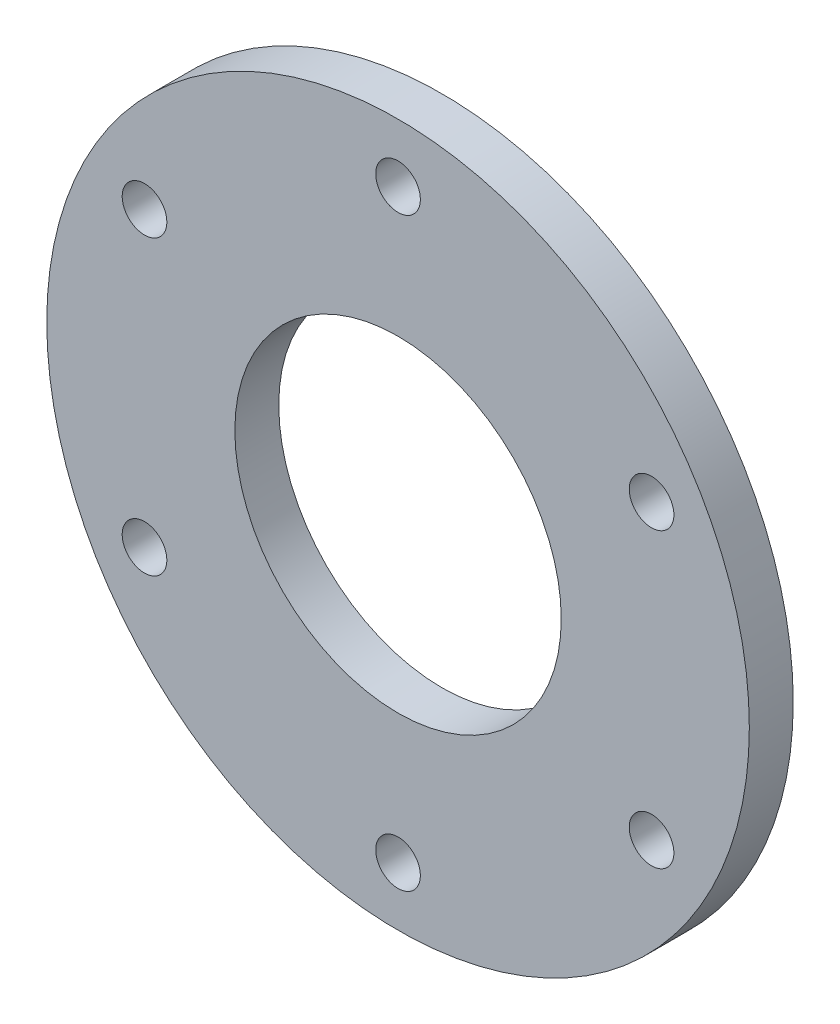
ISO-10303-21;
HEADER;
FILE_DESCRIPTION(('STEP AP214'),'2;1');
FILE_NAME('part.step','',(''),(''),'','','');
FILE_SCHEMA(('AUTOMOTIVE_DESIGN { 1 0 10303 214 1 1 1 1 }'));
ENDSEC;
DATA;
#1=APPLICATION_CONTEXT('core data for automotive mechanical design processes');
#2=APPLICATION_PROTOCOL_DEFINITION('international standard','automotive_design',2000,#1);
#3=PRODUCT_CONTEXT('',#1,'mechanical');
#4=PRODUCT('Part','Part','',(#3));
#5=PRODUCT_RELATED_PRODUCT_CATEGORY('part','',(#4));
#6=PRODUCT_DEFINITION_FORMATION('','',#4);
#7=PRODUCT_DEFINITION_CONTEXT('part definition',#1,'design');
#8=PRODUCT_DEFINITION('design','',#6,#7);
#9=PRODUCT_DEFINITION_SHAPE('','',#8);
#10=(LENGTH_UNIT() NAMED_UNIT(*) SI_UNIT(.MILLI.,.METRE.));
#11=(NAMED_UNIT(*) PLANE_ANGLE_UNIT() SI_UNIT($,.RADIAN.));
#12=(NAMED_UNIT(*) SI_UNIT($,.STERADIAN.) SOLID_ANGLE_UNIT());
#13=UNCERTAINTY_MEASURE_WITH_UNIT(LENGTH_MEASURE(1.E-05),#10,'distance_accuracy_value','');
#14=(GEOMETRIC_REPRESENTATION_CONTEXT(3) GLOBAL_UNCERTAINTY_ASSIGNED_CONTEXT((#13)) GLOBAL_UNIT_ASSIGNED_CONTEXT((#10,
#11,#12)) REPRESENTATION_CONTEXT('',''));
#15=CARTESIAN_POINT('',(0.,0.,0.));
#16=DIRECTION('',(0.,0.,1.));
#17=DIRECTION('',(1.,0.,0.));
#18=AXIS2_PLACEMENT_3D('',#15,#16,#17);
#19=CARTESIAN_POINT('',(0.,0.,3.));
#20=DIRECTION('',(0.,0.,1.));
#21=DIRECTION('',(1.,0.,0.));
#22=AXIS2_PLACEMENT_3D('',#19,#20,#21);
#23=PLANE('',#22);
#24=CARTESIAN_POINT('',(-17.3205080756888,-10.,3.));
#25=DIRECTION('',(0.,0.,1.));
#26=DIRECTION('',(1.,0.,0.));
#27=AXIS2_PLACEMENT_3D('',#24,#25,#26);
#28=CIRCLE('',#27,1.525);
#29=CARTESIAN_POINT('',(-15.7955080756888,-10.,3.));
#30=VERTEX_POINT('',#29);
#31=EDGE_CURVE('E72',#30,#30,#28,.T.);
#32=ORIENTED_EDGE('',*,*,#31,.F.);
#33=EDGE_LOOP('',(#32));
#34=FACE_BOUND('',#33,.T.);
#35=CARTESIAN_POINT('',(17.3205080756888,-10.,3.));
#36=DIRECTION('',(0.,0.,1.));
#37=DIRECTION('',(1.,0.,0.));
#38=AXIS2_PLACEMENT_3D('',#35,#36,#37);
#39=CIRCLE('',#38,1.525);
#40=CARTESIAN_POINT('',(18.8455080756888,-10.,3.));
#41=VERTEX_POINT('',#40);
#42=EDGE_CURVE('E60',#41,#41,#39,.T.);
#43=ORIENTED_EDGE('',*,*,#42,.F.);
#44=EDGE_LOOP('',(#43));
#45=FACE_BOUND('',#44,.T.);
#46=CARTESIAN_POINT('',(0.,20.,3.));
#47=DIRECTION('',(0.,0.,1.));
#48=DIRECTION('',(1.,0.,0.));
#49=AXIS2_PLACEMENT_3D('',#46,#47,#48);
#50=CIRCLE('',#49,1.525);
#51=CARTESIAN_POINT('',(1.525,20.,3.));
#52=VERTEX_POINT('',#51);
#53=EDGE_CURVE('E48',#52,#52,#50,.T.);
#54=ORIENTED_EDGE('',*,*,#53,.F.);
#55=EDGE_LOOP('',(#54));
#56=FACE_BOUND('',#55,.T.);
#57=CARTESIAN_POINT('',(0.,0.,3.));
#58=DIRECTION('',(0.,0.,1.));
#59=DIRECTION('',(1.,0.,0.));
#60=AXIS2_PLACEMENT_3D('',#57,#58,#59);
#61=CIRCLE('',#60,24.);
#62=CARTESIAN_POINT('',(24.,0.,3.));
#63=VERTEX_POINT('',#62);
#64=EDGE_CURVE('E10',#63,#63,#61,.T.);
#65=ORIENTED_EDGE('',*,*,#64,.T.);
#66=EDGE_LOOP('',(#65));
#67=FACE_BOUND('',#66,.T.);
#68=CARTESIAN_POINT('',(0.,0.,3.));
#69=DIRECTION('',(0.,0.,1.));
#70=DIRECTION('',(1.,0.,0.));
#71=AXIS2_PLACEMENT_3D('',#68,#69,#70);
#72=CIRCLE('',#71,11.15);
#73=CARTESIAN_POINT('',(11.15,0.,3.));
#74=VERTEX_POINT('',#73);
#75=EDGE_CURVE('E43',#74,#74,#72,.T.);
#76=ORIENTED_EDGE('',*,*,#75,.F.);
#77=EDGE_LOOP('',(#76));
#78=FACE_BOUND('',#77,.T.);
#79=CARTESIAN_POINT('',(17.3205080756888,10.,3.));
#80=DIRECTION('',(0.,0.,1.));
#81=DIRECTION('',(1.,0.,0.));
#82=AXIS2_PLACEMENT_3D('',#79,#80,#81);
#83=CIRCLE('',#82,1.525);
#84=CARTESIAN_POINT('',(18.8455080756888,10.,3.));
#85=VERTEX_POINT('',#84);
#86=EDGE_CURVE('E54',#85,#85,#83,.T.);
#87=ORIENTED_EDGE('',*,*,#86,.F.);
#88=EDGE_LOOP('',(#87));
#89=FACE_BOUND('',#88,.T.);
#90=CARTESIAN_POINT('',(0.,-20.,3.));
#91=DIRECTION('',(0.,0.,1.));
#92=DIRECTION('',(1.,0.,0.));
#93=AXIS2_PLACEMENT_3D('',#90,#91,#92);
#94=CIRCLE('',#93,1.525);
#95=CARTESIAN_POINT('',(1.525,-20.,3.));
#96=VERTEX_POINT('',#95);
#97=EDGE_CURVE('E66',#96,#96,#94,.T.);
#98=ORIENTED_EDGE('',*,*,#97,.F.);
#99=EDGE_LOOP('',(#98));
#100=FACE_BOUND('',#99,.T.);
#101=CARTESIAN_POINT('',(-17.3205080756888,9.99999999999999,3.));
#102=DIRECTION('',(0.,0.,1.));
#103=DIRECTION('',(1.,0.,0.));
#104=AXIS2_PLACEMENT_3D('',#101,#102,#103);
#105=CIRCLE('',#104,1.525);
#106=CARTESIAN_POINT('',(-15.7955080756888,9.99999999999999,3.));
#107=VERTEX_POINT('',#106);
#108=EDGE_CURVE('E78',#107,#107,#105,.T.);
#109=ORIENTED_EDGE('',*,*,#108,.F.);
#110=EDGE_LOOP('',(#109));
#111=FACE_BOUND('',#110,.T.);
#112=ADVANCED_FACE('F32',(#34,#45,#56,#67,#78,#89,#100,#111),#23,.T.);
#113=CARTESIAN_POINT('',(0.,0.,0.));
#114=DIRECTION('',(0.,0.,1.));
#115=DIRECTION('',(1.,0.,0.));
#116=AXIS2_PLACEMENT_3D('',#113,#114,#115);
#117=PLANE('',#116);
#118=CARTESIAN_POINT('',(0.,0.,0.));
#119=DIRECTION('',(0.,0.,1.));
#120=DIRECTION('',(1.,0.,0.));
#121=AXIS2_PLACEMENT_3D('',#118,#119,#120);
#122=CIRCLE('',#121,24.);
#123=CARTESIAN_POINT('',(24.,0.,0.));
#124=VERTEX_POINT('',#123);
#125=EDGE_CURVE('E36',#124,#124,#122,.T.);
#126=ORIENTED_EDGE('',*,*,#125,.F.);
#127=EDGE_LOOP('',(#126));
#128=FACE_BOUND('',#127,.T.);
#129=CARTESIAN_POINT('',(0.,0.,0.));
#130=DIRECTION('',(0.,0.,1.));
#131=DIRECTION('',(1.,0.,0.));
#132=AXIS2_PLACEMENT_3D('',#129,#130,#131);
#133=CIRCLE('',#132,11.15);
#134=CARTESIAN_POINT('',(11.15,0.,0.));
#135=VERTEX_POINT('',#134);
#136=EDGE_CURVE('E45',#135,#135,#133,.T.);
#137=ORIENTED_EDGE('',*,*,#136,.T.);
#138=EDGE_LOOP('',(#137));
#139=FACE_BOUND('',#138,.T.);
#140=CARTESIAN_POINT('',(0.,20.,0.));
#141=DIRECTION('',(0.,0.,1.));
#142=DIRECTION('',(1.,0.,0.));
#143=AXIS2_PLACEMENT_3D('',#140,#141,#142);
#144=CIRCLE('',#143,1.525);
#145=CARTESIAN_POINT('',(1.525,20.,0.));
#146=VERTEX_POINT('',#145);
#147=EDGE_CURVE('E51',#146,#146,#144,.T.);
#148=ORIENTED_EDGE('',*,*,#147,.T.);
#149=EDGE_LOOP('',(#148));
#150=FACE_BOUND('',#149,.T.);
#151=CARTESIAN_POINT('',(17.3205080756888,10.,0.));
#152=DIRECTION('',(0.,0.,1.));
#153=DIRECTION('',(1.,0.,0.));
#154=AXIS2_PLACEMENT_3D('',#151,#152,#153);
#155=CIRCLE('',#154,1.525);
#156=CARTESIAN_POINT('',(18.8455080756888,10.,0.));
#157=VERTEX_POINT('',#156);
#158=EDGE_CURVE('E57',#157,#157,#155,.T.);
#159=ORIENTED_EDGE('',*,*,#158,.T.);
#160=EDGE_LOOP('',(#159));
#161=FACE_BOUND('',#160,.T.);
#162=CARTESIAN_POINT('',(17.3205080756888,-10.,0.));
#163=DIRECTION('',(0.,0.,1.));
#164=DIRECTION('',(1.,0.,0.));
#165=AXIS2_PLACEMENT_3D('',#162,#163,#164);
#166=CIRCLE('',#165,1.525);
#167=CARTESIAN_POINT('',(18.8455080756888,-10.,0.));
#168=VERTEX_POINT('',#167);
#169=EDGE_CURVE('E63',#168,#168,#166,.T.);
#170=ORIENTED_EDGE('',*,*,#169,.T.);
#171=EDGE_LOOP('',(#170));
#172=FACE_BOUND('',#171,.T.);
#173=CARTESIAN_POINT('',(0.,-20.,0.));
#174=DIRECTION('',(0.,0.,1.));
#175=DIRECTION('',(1.,0.,0.));
#176=AXIS2_PLACEMENT_3D('',#173,#174,#175);
#177=CIRCLE('',#176,1.525);
#178=CARTESIAN_POINT('',(1.525,-20.,0.));
#179=VERTEX_POINT('',#178);
#180=EDGE_CURVE('E69',#179,#179,#177,.T.);
#181=ORIENTED_EDGE('',*,*,#180,.T.);
#182=EDGE_LOOP('',(#181));
#183=FACE_BOUND('',#182,.T.);
#184=CARTESIAN_POINT('',(-17.3205080756888,-10.,0.));
#185=DIRECTION('',(0.,0.,1.));
#186=DIRECTION('',(1.,0.,0.));
#187=AXIS2_PLACEMENT_3D('',#184,#185,#186);
#188=CIRCLE('',#187,1.525);
#189=CARTESIAN_POINT('',(-15.7955080756888,-10.,0.));
#190=VERTEX_POINT('',#189);
#191=EDGE_CURVE('E75',#190,#190,#188,.T.);
#192=ORIENTED_EDGE('',*,*,#191,.T.);
#193=EDGE_LOOP('',(#192));
#194=FACE_BOUND('',#193,.T.);
#195=CARTESIAN_POINT('',(-17.3205080756888,9.99999999999999,0.));
#196=DIRECTION('',(0.,0.,1.));
#197=DIRECTION('',(1.,0.,0.));
#198=AXIS2_PLACEMENT_3D('',#195,#196,#197);
#199=CIRCLE('',#198,1.525);
#200=CARTESIAN_POINT('',(-15.7955080756888,9.99999999999999,0.));
#201=VERTEX_POINT('',#200);
#202=EDGE_CURVE('E81',#201,#201,#199,.T.);
#203=ORIENTED_EDGE('',*,*,#202,.T.);
#204=EDGE_LOOP('',(#203));
#205=FACE_BOUND('',#204,.T.);
#206=ADVANCED_FACE('F91',(#128,#139,#150,#161,#172,#183,#194,#205),#117,.F.);
#207=CARTESIAN_POINT('',(0.,0.,3.));
#208=DIRECTION('',(0.,0.,-1.));
#209=DIRECTION('',(-1.,0.,0.));
#210=AXIS2_PLACEMENT_3D('',#207,#208,#209);
#211=CYLINDRICAL_SURFACE('',#210,24.);
#212=ORIENTED_EDGE('',*,*,#64,.F.);
#213=EDGE_LOOP('',(#212));
#214=FACE_BOUND('',#213,.T.);
#215=ORIENTED_EDGE('',*,*,#125,.T.);
#216=EDGE_LOOP('',(#215));
#217=FACE_BOUND('',#216,.T.);
#218=ADVANCED_FACE('F34',(#214,#217),#211,.T.);
#219=CARTESIAN_POINT('',(0.,0.,3.));
#220=DIRECTION('',(0.,0.,-1.));
#221=DIRECTION('',(-1.,0.,0.));
#222=AXIS2_PLACEMENT_3D('',#219,#220,#221);
#223=CYLINDRICAL_SURFACE('',#222,11.15);
#224=ORIENTED_EDGE('',*,*,#75,.T.);
#225=EDGE_LOOP('',(#224));
#226=FACE_BOUND('',#225,.T.);
#227=ORIENTED_EDGE('',*,*,#136,.F.);
#228=EDGE_LOOP('',(#227));
#229=FACE_BOUND('',#228,.T.);
#230=ADVANCED_FACE('F101',(#226,#229),#223,.F.);
#231=CARTESIAN_POINT('',(0.,20.,3.));
#232=DIRECTION('',(0.,0.,-1.));
#233=DIRECTION('',(-1.,0.,0.));
#234=AXIS2_PLACEMENT_3D('',#231,#232,#233);
#235=CYLINDRICAL_SURFACE('',#234,1.525);
#236=ORIENTED_EDGE('',*,*,#53,.T.);
#237=EDGE_LOOP('',(#236));
#238=FACE_BOUND('',#237,.T.);
#239=ORIENTED_EDGE('',*,*,#147,.F.);
#240=EDGE_LOOP('',(#239));
#241=FACE_BOUND('',#240,.T.);
#242=ADVANCED_FACE('F104',(#238,#241),#235,.F.);
#243=CARTESIAN_POINT('',(17.3205080756888,10.,3.));
#244=DIRECTION('',(0.,0.,-1.));
#245=DIRECTION('',(-1.,0.,0.));
#246=AXIS2_PLACEMENT_3D('',#243,#244,#245);
#247=CYLINDRICAL_SURFACE('',#246,1.525);
#248=ORIENTED_EDGE('',*,*,#86,.T.);
#249=EDGE_LOOP('',(#248));
#250=FACE_BOUND('',#249,.T.);
#251=ORIENTED_EDGE('',*,*,#158,.F.);
#252=EDGE_LOOP('',(#251));
#253=FACE_BOUND('',#252,.T.);
#254=ADVANCED_FACE('F108',(#250,#253),#247,.F.);
#255=CARTESIAN_POINT('',(17.3205080756888,-10.,3.));
#256=DIRECTION('',(0.,0.,-1.));
#257=DIRECTION('',(-1.,0.,0.));
#258=AXIS2_PLACEMENT_3D('',#255,#256,#257);
#259=CYLINDRICAL_SURFACE('',#258,1.525);
#260=ORIENTED_EDGE('',*,*,#42,.T.);
#261=EDGE_LOOP('',(#260));
#262=FACE_BOUND('',#261,.T.);
#263=ORIENTED_EDGE('',*,*,#169,.F.);
#264=EDGE_LOOP('',(#263));
#265=FACE_BOUND('',#264,.T.);
#266=ADVANCED_FACE('F112',(#262,#265),#259,.F.);
#267=CARTESIAN_POINT('',(0.,-20.,3.));
#268=DIRECTION('',(0.,0.,-1.));
#269=DIRECTION('',(-1.,0.,0.));
#270=AXIS2_PLACEMENT_3D('',#267,#268,#269);
#271=CYLINDRICAL_SURFACE('',#270,1.525);
#272=ORIENTED_EDGE('',*,*,#97,.T.);
#273=EDGE_LOOP('',(#272));
#274=FACE_BOUND('',#273,.T.);
#275=ORIENTED_EDGE('',*,*,#180,.F.);
#276=EDGE_LOOP('',(#275));
#277=FACE_BOUND('',#276,.T.);
#278=ADVANCED_FACE('F116',(#274,#277),#271,.F.);
#279=CARTESIAN_POINT('',(-17.3205080756888,-10.,3.));
#280=DIRECTION('',(0.,0.,-1.));
#281=DIRECTION('',(-1.,0.,0.));
#282=AXIS2_PLACEMENT_3D('',#279,#280,#281);
#283=CYLINDRICAL_SURFACE('',#282,1.525);
#284=ORIENTED_EDGE('',*,*,#31,.T.);
#285=EDGE_LOOP('',(#284));
#286=FACE_BOUND('',#285,.T.);
#287=ORIENTED_EDGE('',*,*,#191,.F.);
#288=EDGE_LOOP('',(#287));
#289=FACE_BOUND('',#288,.T.);
#290=ADVANCED_FACE('F120',(#286,#289),#283,.F.);
#291=CARTESIAN_POINT('',(-17.3205080756888,9.99999999999999,3.));
#292=DIRECTION('',(0.,0.,-1.));
#293=DIRECTION('',(-1.,0.,0.));
#294=AXIS2_PLACEMENT_3D('',#291,#292,#293);
#295=CYLINDRICAL_SURFACE('',#294,1.525);
#296=ORIENTED_EDGE('',*,*,#108,.T.);
#297=EDGE_LOOP('',(#296));
#298=FACE_BOUND('',#297,.T.);
#299=ORIENTED_EDGE('',*,*,#202,.F.);
#300=EDGE_LOOP('',(#299));
#301=FACE_BOUND('',#300,.T.);
#302=ADVANCED_FACE('F87',(#298,#301),#295,.F.);
#303=CLOSED_SHELL('',(#112,#206,#218,#230,#242,#254,#266,#278,#290,#302));
#304=MANIFOLD_SOLID_BREP('B2',#303);
#305=ADVANCED_BREP_SHAPE_REPRESENTATION('',(#18,#304),#14);
#306=SHAPE_DEFINITION_REPRESENTATION(#9,#305);
ENDSEC;
END-ISO-10303-21;
